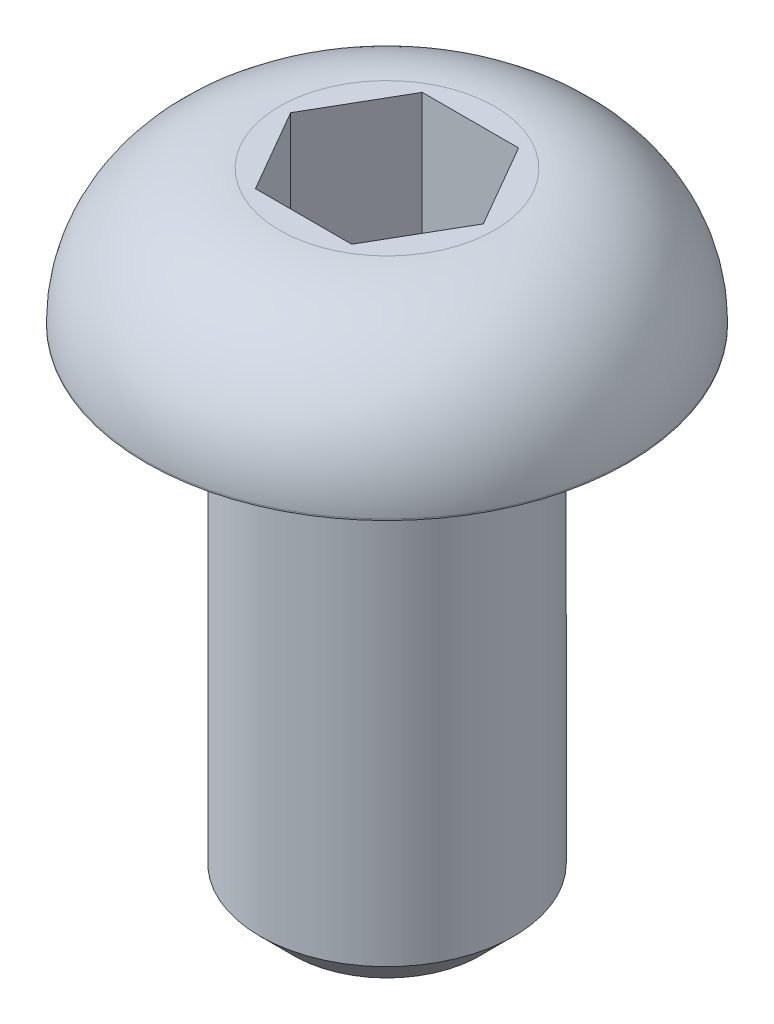
ISO-10303-21;
HEADER;
FILE_DESCRIPTION(('STEP AP214'),'2;1');
FILE_NAME('part.step','',(''),(''),'','','');
FILE_SCHEMA(('AUTOMOTIVE_DESIGN { 1 0 10303 214 1 1 1 1 }'));
ENDSEC;
DATA;
#1=APPLICATION_CONTEXT('core data for automotive mechanical design processes');
#2=APPLICATION_PROTOCOL_DEFINITION('international standard','automotive_design',2000,#1);
#3=PRODUCT_CONTEXT('',#1,'mechanical');
#4=PRODUCT('Part','Part','',(#3));
#5=PRODUCT_RELATED_PRODUCT_CATEGORY('part','',(#4));
#6=PRODUCT_DEFINITION_FORMATION('','',#4);
#7=PRODUCT_DEFINITION_CONTEXT('part definition',#1,'design');
#8=PRODUCT_DEFINITION('design','',#6,#7);
#9=PRODUCT_DEFINITION_SHAPE('','',#8);
#10=(LENGTH_UNIT() NAMED_UNIT(*) SI_UNIT(.MILLI.,.METRE.));
#11=(NAMED_UNIT(*) PLANE_ANGLE_UNIT() SI_UNIT($,.RADIAN.));
#12=(NAMED_UNIT(*) SI_UNIT($,.STERADIAN.) SOLID_ANGLE_UNIT());
#13=UNCERTAINTY_MEASURE_WITH_UNIT(LENGTH_MEASURE(1.E-05),#10,'distance_accuracy_value','');
#14=(GEOMETRIC_REPRESENTATION_CONTEXT(3) GLOBAL_UNCERTAINTY_ASSIGNED_CONTEXT((#13)) GLOBAL_UNIT_ASSIGNED_CONTEXT((#10,
#11,#12)) REPRESENTATION_CONTEXT('',''));
#15=CARTESIAN_POINT('',(0.,0.,0.));
#16=DIRECTION('',(0.,0.,1.));
#17=DIRECTION('',(1.,0.,0.));
#18=AXIS2_PLACEMENT_3D('',#15,#16,#17);
#19=CARTESIAN_POINT('',(-1.799336,-9.525,1.799336));
#20=DIRECTION('',(0.,-1.,0.));
#21=DIRECTION('',(0.,0.,-1.));
#22=AXIS2_PLACEMENT_3D('',#19,#20,#21);
#23=PLANE('',#22);
#24=CARTESIAN_POINT('',(0.,-9.52500000000001,0.));
#25=DIRECTION('',(0.,1.,0.));
#26=DIRECTION('',(-1.,0.,0.));
#27=AXIS2_PLACEMENT_3D('',#24,#25,#26);
#28=CIRCLE('',#27,1.778);
#29=CARTESIAN_POINT('',(-1.778,-9.52500000000001,0.));
#30=VERTEX_POINT('',#29);
#31=EDGE_CURVE('E21',#30,#30,#28,.F.);
#32=ORIENTED_EDGE('',*,*,#31,.T.);
#33=EDGE_LOOP('',(#32));
#34=FACE_BOUND('',#33,.T.);
#35=ADVANCED_FACE('F17',(#34),#23,.T.);
#36=CARTESIAN_POINT('',(0.,-9.525,0.));
#37=DIRECTION('',(0.,1.,0.));
#38=DIRECTION('',(-1.,0.,0.));
#39=AXIS2_PLACEMENT_3D('',#36,#37,#38);
#40=CONICAL_SURFACE('',#39,1.778,0.785398163397448);
#41=ORIENTED_EDGE('',*,*,#31,.F.);
#42=EDGE_LOOP('',(#41));
#43=FACE_BOUND('',#42,.T.);
#44=CARTESIAN_POINT('',(0.,-8.89,0.));
#45=DIRECTION('',(0.,1.,0.));
#46=DIRECTION('',(0.,0.,1.));
#47=AXIS2_PLACEMENT_3D('',#44,#45,#46);
#48=CIRCLE('',#47,2.413);
#49=CARTESIAN_POINT('',(0.,-8.89,2.413));
#50=VERTEX_POINT('',#49);
#51=EDGE_CURVE('E280',#50,#50,#48,.F.);
#52=ORIENTED_EDGE('',*,*,#51,.T.);
#53=EDGE_LOOP('',(#52));
#54=FACE_BOUND('',#53,.T.);
#55=ADVANCED_FACE('F155',(#43,#54),#40,.T.);
#56=CARTESIAN_POINT('',(-1.833087105,0.,1.5875));
#57=DIRECTION('',(0.,-1.,0.));
#58=DIRECTION('',(0.,0.,-1.));
#59=AXIS2_PLACEMENT_3D('',#56,#57,#58);
#60=PLANE('',#59);
#61=DIRECTION('',(0.500000000270637,0.,-0.866025403628186));
#62=VECTOR('',#61,1.);
#63=CARTESIAN_POINT('',(-1.3748153285,0.,-0.79375));
#64=LINE('',#63,#62);
#65=CARTESIAN_POINT('',(-1.83308710474382,0.,4.43719754407261E-10));
#66=VERTEX_POINT('',#65);
#67=CARTESIAN_POINT('',(-0.91654355225,0.,-1.5875));
#68=VERTEX_POINT('',#67);
#69=EDGE_CURVE('E84',#66,#68,#64,.T.);
#70=ORIENTED_EDGE('',*,*,#69,.F.);
#71=DIRECTION('',(-0.500000000270637,0.,-0.866025403628186));
#72=VECTOR('',#71,1.);
#73=CARTESIAN_POINT('',(-1.3748153285,0.,0.79375));
#74=LINE('',#73,#72);
#75=CARTESIAN_POINT('',(-0.916543552125,0.,1.5875));
#76=VERTEX_POINT('',#75);
#77=EDGE_CURVE('E76',#76,#66,#74,.T.);
#78=ORIENTED_EDGE('',*,*,#77,.F.);
#79=DIRECTION('',(-1.,0.,0.));
#80=VECTOR('',#79,1.);
#81=CARTESIAN_POINT('',(0.,0.,1.5875));
#82=LINE('',#81,#80);
#83=CARTESIAN_POINT('',(0.916543552125,0.,1.5875));
#84=VERTEX_POINT('',#83);
#85=EDGE_CURVE('E113',#84,#76,#82,.T.);
#86=ORIENTED_EDGE('',*,*,#85,.F.);
#87=DIRECTION('',(-0.500000000270637,0.,0.866025403628186));
#88=VECTOR('',#87,1.);
#89=CARTESIAN_POINT('',(1.3748153285,0.,0.79375));
#90=LINE('',#89,#88);
#91=CARTESIAN_POINT('',(1.83308710474382,0.,-4.43719754407261E-10));
#92=VERTEX_POINT('',#91);
#93=EDGE_CURVE('E109',#92,#84,#90,.T.);
#94=ORIENTED_EDGE('',*,*,#93,.F.);
#95=DIRECTION('',(0.500000000270637,0.,0.866025403628186));
#96=VECTOR('',#95,1.);
#97=CARTESIAN_POINT('',(1.3748153285,0.,-0.79375));
#98=LINE('',#97,#96);
#99=CARTESIAN_POINT('',(0.916543552125,0.,-1.5875));
#100=VERTEX_POINT('',#99);
#101=EDGE_CURVE('E105',#100,#92,#98,.T.);
#102=ORIENTED_EDGE('',*,*,#101,.F.);
#103=DIRECTION('',(1.,0.,0.));
#104=VECTOR('',#103,1.);
#105=CARTESIAN_POINT('',(0.,0.,-1.5875));
#106=LINE('',#105,#104);
#107=EDGE_CURVE('E87',#68,#100,#106,.T.);
#108=ORIENTED_EDGE('',*,*,#107,.F.);
#109=EDGE_LOOP('',(#70,#78,#86,#94,#102,#108));
#110=FACE_BOUND('',#109,.T.);
#111=ADVANCED_FACE('F85',(#110),#60,.F.);
#112=CARTESIAN_POINT('',(0.,-8.89,0.));
#113=DIRECTION('',(0.,1.,0.));
#114=DIRECTION('',(0.,0.,1.));
#115=AXIS2_PLACEMENT_3D('',#112,#113,#114);
#116=CYLINDRICAL_SURFACE('',#115,2.413);
#117=ORIENTED_EDGE('',*,*,#51,.F.);
#118=EDGE_LOOP('',(#117));
#119=FACE_BOUND('',#118,.T.);
#120=CARTESIAN_POINT('',(0.,0.,0.));
#121=DIRECTION('',(0.,1.,0.));
#122=DIRECTION('',(0.,0.,1.));
#123=AXIS2_PLACEMENT_3D('',#120,#121,#122);
#124=CIRCLE('',#123,2.413);
#125=CARTESIAN_POINT('',(0.,0.,2.413));
#126=VERTEX_POINT('',#125);
#127=EDGE_CURVE('E102',#126,#126,#124,.F.);
#128=ORIENTED_EDGE('',*,*,#127,.T.);
#129=EDGE_LOOP('',(#128));
#130=FACE_BOUND('',#129,.T.);
#131=ADVANCED_FACE('F129',(#119,#130),#116,.T.);
#132=CARTESIAN_POINT('',(-0.916543552,0.,-1.5875));
#133=DIRECTION('',(0.,0.,1.));
#134=DIRECTION('',(1.,0.,0.));
#135=AXIS2_PLACEMENT_3D('',#132,#133,#134);
#136=PLANE('',#135);
#137=DIRECTION('',(0.,-1.,0.));
#138=VECTOR('',#137,1.);
#139=CARTESIAN_POINT('',(0.916543552,1.2827,-1.5875));
#140=LINE('',#139,#138);
#141=CARTESIAN_POINT('',(0.916543551841248,2.5654,-1.58749999898468));
#142=VERTEX_POINT('',#141);
#143=EDGE_CURVE('E51',#142,#100,#140,.T.);
#144=ORIENTED_EDGE('',*,*,#143,.F.);
#145=DIRECTION('',(1.,0.,0.));
#146=VECTOR('',#145,1.);
#147=CARTESIAN_POINT('',(0.,2.5654,-1.58749999818441));
#148=LINE('',#147,#146);
#149=CARTESIAN_POINT('',(-0.916543551841248,2.5654,-1.58749999898468));
#150=VERTEX_POINT('',#149);
#151=EDGE_CURVE('E57',#150,#142,#148,.T.);
#152=ORIENTED_EDGE('',*,*,#151,.F.);
#153=DIRECTION('',(0.,1.,0.));
#154=VECTOR('',#153,1.);
#155=CARTESIAN_POINT('',(-0.916543552,1.2827,-1.5875));
#156=LINE('',#155,#154);
#157=EDGE_CURVE('E89',#68,#150,#156,.T.);
#158=ORIENTED_EDGE('',*,*,#157,.F.);
#159=ORIENTED_EDGE('',*,*,#107,.T.);
#160=EDGE_LOOP('',(#144,#152,#158,#159));
#161=FACE_BOUND('',#160,.T.);
#162=ADVANCED_FACE('F153',(#161),#136,.T.);
#163=CARTESIAN_POINT('',(0.916543552,0.,-1.5875));
#164=DIRECTION('',(-0.866025403628186,0.,0.500000000270637));
#165=DIRECTION('',(0.500000000270637,0.,0.866025403628186));
#166=AXIS2_PLACEMENT_3D('',#163,#164,#165);
#167=PLANE('',#166);
#168=DIRECTION('',(0.,-1.,0.));
#169=VECTOR('',#168,1.);
#170=CARTESIAN_POINT('',(1.833087105,1.2827,0.));
#171=LINE('',#170,#169);
#172=CARTESIAN_POINT('',(1.83308710438808,2.5654,9.63517689380676E-11));
#173=VERTEX_POINT('',#172);
#174=EDGE_CURVE('E106',#173,#92,#171,.T.);
#175=ORIENTED_EDGE('',*,*,#174,.F.);
#176=DIRECTION('',(0.500000000312862,0.,0.866025403603808));
#177=VECTOR('',#176,1.);
#178=CARTESIAN_POINT('',(0.91654355205497,2.5654,-1.58749999818441));
#179=LINE('',#178,#177);
#180=EDGE_CURVE('E101',#142,#173,#179,.T.);
#181=ORIENTED_EDGE('',*,*,#180,.F.);
#182=ORIENTED_EDGE('',*,*,#143,.T.);
#183=ORIENTED_EDGE('',*,*,#101,.T.);
#184=EDGE_LOOP('',(#175,#181,#182,#183));
#185=FACE_BOUND('',#184,.T.);
#186=ADVANCED_FACE('F166',(#185),#167,.T.);
#187=CARTESIAN_POINT('',(1.833087105,0.,0.));
#188=DIRECTION('',(-0.866025403628186,0.,-0.500000000270637));
#189=DIRECTION('',(-0.500000000270637,0.,0.866025403628186));
#190=AXIS2_PLACEMENT_3D('',#187,#188,#189);
#191=PLANE('',#190);
#192=DIRECTION('',(0.,-1.,0.));
#193=VECTOR('',#192,1.);
#194=CARTESIAN_POINT('',(0.916543552,1.2827,1.5875));
#195=LINE('',#194,#193);
#196=CARTESIAN_POINT('',(0.916543551841248,2.5654,1.58749999898468));
#197=VERTEX_POINT('',#196);
#198=EDGE_CURVE('E110',#197,#84,#195,.T.);
#199=ORIENTED_EDGE('',*,*,#198,.F.);
#200=DIRECTION('',(-0.500000000312862,0.,0.866025403603808));
#201=VECTOR('',#200,1.);
#202=CARTESIAN_POINT('',(1.83308710410994,2.5654,0.));
#203=LINE('',#202,#201);
#204=EDGE_CURVE('E122',#173,#197,#203,.T.);
#205=ORIENTED_EDGE('',*,*,#204,.F.);
#206=ORIENTED_EDGE('',*,*,#174,.T.);
#207=ORIENTED_EDGE('',*,*,#93,.T.);
#208=EDGE_LOOP('',(#199,#205,#206,#207));
#209=FACE_BOUND('',#208,.T.);
#210=ADVANCED_FACE('F169',(#209),#191,.T.);
#211=CARTESIAN_POINT('',(0.916543552,0.,1.5875));
#212=DIRECTION('',(0.,0.,-1.));
#213=DIRECTION('',(-1.,0.,0.));
#214=AXIS2_PLACEMENT_3D('',#211,#212,#213);
#215=PLANE('',#214);
#216=DIRECTION('',(0.,-1.,0.));
#217=VECTOR('',#216,1.);
#218=CARTESIAN_POINT('',(-0.916543552,1.2827,1.5875));
#219=LINE('',#218,#217);
#220=CARTESIAN_POINT('',(-0.916543551841248,2.5654,1.58749999898468));
#221=VERTEX_POINT('',#220);
#222=EDGE_CURVE('E79',#221,#76,#219,.T.);
#223=ORIENTED_EDGE('',*,*,#222,.F.);
#224=DIRECTION('',(-1.,0.,0.));
#225=VECTOR('',#224,1.);
#226=CARTESIAN_POINT('',(0.,2.5654,1.58749999818441));
#227=LINE('',#226,#225);
#228=EDGE_CURVE('E98',#197,#221,#227,.T.);
#229=ORIENTED_EDGE('',*,*,#228,.F.);
#230=ORIENTED_EDGE('',*,*,#198,.T.);
#231=ORIENTED_EDGE('',*,*,#85,.T.);
#232=EDGE_LOOP('',(#223,#229,#230,#231));
#233=FACE_BOUND('',#232,.T.);
#234=ADVANCED_FACE('F173',(#233),#215,.T.);
#235=CARTESIAN_POINT('',(-0.916543552,0.,1.5875));
#236=DIRECTION('',(0.866025403628186,0.,-0.500000000270637));
#237=DIRECTION('',(-0.500000000270637,0.,-0.866025403628186));
#238=AXIS2_PLACEMENT_3D('',#235,#236,#237);
#239=PLANE('',#238);
#240=DIRECTION('',(0.,-1.,0.));
#241=VECTOR('',#240,1.);
#242=CARTESIAN_POINT('',(-1.833087105,1.2827,0.));
#243=LINE('',#242,#241);
#244=CARTESIAN_POINT('',(-1.83308710438808,2.5654,-9.63516605178504E-11));
#245=VERTEX_POINT('',#244);
#246=EDGE_CURVE('E36',#245,#66,#243,.T.);
#247=ORIENTED_EDGE('',*,*,#246,.F.);
#248=DIRECTION('',(-0.500000000312862,0.,-0.866025403603808));
#249=VECTOR('',#248,1.);
#250=CARTESIAN_POINT('',(-0.91654355205497,2.5654,1.58749999818441));
#251=LINE('',#250,#249);
#252=EDGE_CURVE('E120',#221,#245,#251,.T.);
#253=ORIENTED_EDGE('',*,*,#252,.F.);
#254=ORIENTED_EDGE('',*,*,#222,.T.);
#255=ORIENTED_EDGE('',*,*,#77,.T.);
#256=EDGE_LOOP('',(#247,#253,#254,#255));
#257=FACE_BOUND('',#256,.T.);
#258=ADVANCED_FACE('F78',(#257),#239,.T.);
#259=CARTESIAN_POINT('',(-1.833087105,0.,0.));
#260=DIRECTION('',(0.866025403628186,0.,0.500000000270637));
#261=DIRECTION('',(0.500000000270637,0.,-0.866025403628186));
#262=AXIS2_PLACEMENT_3D('',#259,#260,#261);
#263=PLANE('',#262);
#264=ORIENTED_EDGE('',*,*,#157,.T.);
#265=DIRECTION('',(0.500000000312862,0.,-0.866025403603808));
#266=VECTOR('',#265,1.);
#267=CARTESIAN_POINT('',(-1.83308710410994,2.5654,0.));
#268=LINE('',#267,#266);
#269=EDGE_CURVE('E93',#245,#150,#268,.T.);
#270=ORIENTED_EDGE('',*,*,#269,.F.);
#271=ORIENTED_EDGE('',*,*,#246,.T.);
#272=ORIENTED_EDGE('',*,*,#69,.T.);
#273=EDGE_LOOP('',(#264,#270,#271,#272));
#274=FACE_BOUND('',#273,.T.);
#275=ADVANCED_FACE('F91',(#274),#263,.T.);
#276=CARTESIAN_POINT('',(-4.6397164,0.,-4.6397164));
#277=DIRECTION('',(0.,1.,0.));
#278=DIRECTION('',(0.,0.,1.));
#279=AXIS2_PLACEMENT_3D('',#276,#277,#278);
#280=PLANE('',#279);
#281=ORIENTED_EDGE('',*,*,#127,.F.);
#282=EDGE_LOOP('',(#281));
#283=FACE_BOUND('',#282,.T.);
#284=CARTESIAN_POINT('',(0.,0.,0.));
#285=DIRECTION('',(0.,-1.,0.));
#286=DIRECTION('',(1.,0.,0.));
#287=AXIS2_PLACEMENT_3D('',#284,#285,#286);
#288=CIRCLE('',#287,4.5847);
#289=CARTESIAN_POINT('',(4.5847,0.,0.));
#290=VERTEX_POINT('',#289);
#291=EDGE_CURVE('E116',#290,#290,#288,.T.);
#292=ORIENTED_EDGE('',*,*,#291,.T.);
#293=EDGE_LOOP('',(#292));
#294=FACE_BOUND('',#293,.T.);
#295=ADVANCED_FACE('F131',(#283,#294),#280,.F.);
#296=CARTESIAN_POINT('',(-2.069288769,2.5654,-2.0692364));
#297=DIRECTION('',(0.,1.,0.));
#298=DIRECTION('',(0.,0.,1.));
#299=AXIS2_PLACEMENT_3D('',#296,#297,#298);
#300=PLANE('',#299);
#301=ORIENTED_EDGE('',*,*,#252,.T.);
#302=ORIENTED_EDGE('',*,*,#269,.T.);
#303=ORIENTED_EDGE('',*,*,#151,.T.);
#304=ORIENTED_EDGE('',*,*,#180,.T.);
#305=ORIENTED_EDGE('',*,*,#204,.T.);
#306=ORIENTED_EDGE('',*,*,#228,.T.);
#307=EDGE_LOOP('',(#301,#302,#303,#304,#305,#306));
#308=FACE_BOUND('',#307,.T.);
#309=CARTESIAN_POINT('',(0.,2.5654,0.));
#310=DIRECTION('',(0.,1.,0.));
#311=DIRECTION('',(0.,0.,1.));
#312=AXIS2_PLACEMENT_3D('',#309,#310,#311);
#313=CIRCLE('',#312,2.0447);
#314=CARTESIAN_POINT('',(0.,2.5654,2.0447));
#315=VERTEX_POINT('',#314);
#316=EDGE_CURVE('E27',#315,#315,#313,.F.);
#317=ORIENTED_EDGE('',*,*,#316,.F.);
#318=EDGE_LOOP('',(#317));
#319=FACE_BOUND('',#318,.T.);
#320=ADVANCED_FACE('F134',(#308,#319),#300,.T.);
#321=CARTESIAN_POINT('',(0.,0.0254,0.));
#322=DIRECTION('',(0.,-1.,0.));
#323=DIRECTION('',(1.,0.,0.));
#324=AXIS2_PLACEMENT_3D('',#321,#322,#323);
#325=CYLINDRICAL_SURFACE('',#324,4.5847);
#326=CARTESIAN_POINT('',(0.,0.0254,0.));
#327=DIRECTION('',(0.,1.,0.));
#328=DIRECTION('',(0.,0.,1.));
#329=AXIS2_PLACEMENT_3D('',#326,#327,#328);
#330=CIRCLE('',#329,4.5847);
#331=CARTESIAN_POINT('',(0.,0.0254,4.5847));
#332=VERTEX_POINT('',#331);
#333=EDGE_CURVE('E11',#332,#332,#330,.T.);
#334=ORIENTED_EDGE('',*,*,#333,.F.);
#335=EDGE_LOOP('',(#334));
#336=FACE_BOUND('',#335,.T.);
#337=ORIENTED_EDGE('',*,*,#291,.F.);
#338=EDGE_LOOP('',(#337));
#339=FACE_BOUND('',#338,.T.);
#340=ADVANCED_FACE('F138',(#336,#339),#325,.T.);
#341=CARTESIAN_POINT('',(0.,0.0254,0.));
#342=DIRECTION('',(0.,1.,0.));
#343=DIRECTION('',(0.,0.,1.));
#344=AXIS2_PLACEMENT_3D('',#341,#342,#343);
#345=DEGENERATE_TOROIDAL_SURFACE('',#344,2.0447,2.54,.T.);
#346=ORIENTED_EDGE('',*,*,#333,.T.);
#347=EDGE_LOOP('',(#346));
#348=FACE_BOUND('',#347,.T.);
#349=ORIENTED_EDGE('',*,*,#316,.T.);
#350=EDGE_LOOP('',(#349));
#351=FACE_BOUND('',#350,.T.);
#352=ADVANCED_FACE('F19',(#348,#351),#345,.T.);
#353=CLOSED_SHELL('',(#35,#55,#111,#131,#162,#186,#210,#234,#258,#275,#295,#320,#340,#352));
#354=MANIFOLD_SOLID_BREP('B1',#353);
#355=ADVANCED_BREP_SHAPE_REPRESENTATION('',(#18,#354),#14);
#356=SHAPE_DEFINITION_REPRESENTATION(#9,#355);
ENDSEC;
END-ISO-10303-21;
